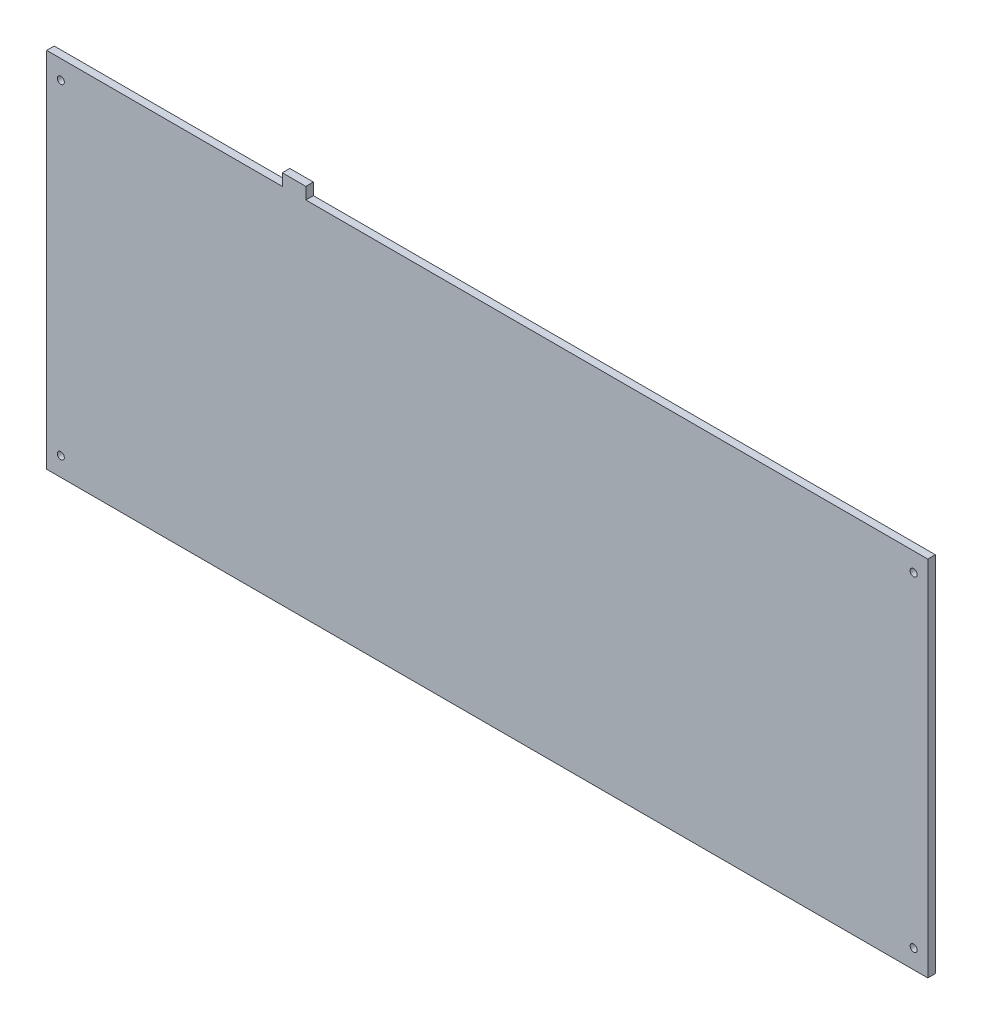
ISO-10303-21;
HEADER;
FILE_DESCRIPTION(('STEP AP214'),'2;1');
FILE_NAME('part.step','',(''),(''),'','','');
FILE_SCHEMA(('AUTOMOTIVE_DESIGN { 1 0 10303 214 1 1 1 1 }'));
ENDSEC;
DATA;
#1=APPLICATION_CONTEXT('core data for automotive mechanical design processes');
#2=APPLICATION_PROTOCOL_DEFINITION('international standard','automotive_design',2000,#1);
#3=PRODUCT_CONTEXT('',#1,'mechanical');
#4=PRODUCT('Part','Part','',(#3));
#5=PRODUCT_RELATED_PRODUCT_CATEGORY('part','',(#4));
#6=PRODUCT_DEFINITION_FORMATION('','',#4);
#7=PRODUCT_DEFINITION_CONTEXT('part definition',#1,'design');
#8=PRODUCT_DEFINITION('design','',#6,#7);
#9=PRODUCT_DEFINITION_SHAPE('','',#8);
#10=(LENGTH_UNIT() NAMED_UNIT(*) SI_UNIT(.MILLI.,.METRE.));
#11=(NAMED_UNIT(*) PLANE_ANGLE_UNIT() SI_UNIT($,.RADIAN.));
#12=(NAMED_UNIT(*) SI_UNIT($,.STERADIAN.) SOLID_ANGLE_UNIT());
#13=UNCERTAINTY_MEASURE_WITH_UNIT(LENGTH_MEASURE(1.E-05),#10,'distance_accuracy_value','');
#14=(GEOMETRIC_REPRESENTATION_CONTEXT(3) GLOBAL_UNCERTAINTY_ASSIGNED_CONTEXT((#13)) GLOBAL_UNIT_ASSIGNED_CONTEXT((#10,
#11,#12)) REPRESENTATION_CONTEXT('',''));
#15=CARTESIAN_POINT('',(0.,0.,0.));
#16=DIRECTION('',(0.,0.,1.));
#17=DIRECTION('',(1.,0.,0.));
#18=AXIS2_PLACEMENT_3D('',#15,#16,#17);
#19=CARTESIAN_POINT('',(0.06942582,-0.06797802,-1.6));
#20=DIRECTION('',(0.,1.,0.));
#21=DIRECTION('',(0.,0.,1.));
#22=AXIS2_PLACEMENT_3D('',#19,#20,#21);
#23=PLANE('',#22);
#24=DIRECTION('',(0.,0.,1.));
#25=VECTOR('',#24,1.);
#26=CARTESIAN_POINT('',(50.06942582,-0.06797802,-1.6));
#27=LINE('',#26,#25);
#28=CARTESIAN_POINT('',(50.06942582,-0.06797802,-1.6));
#29=VERTEX_POINT('',#28);
#30=CARTESIAN_POINT('',(50.06942582,-0.06797802,0.));
#31=VERTEX_POINT('',#30);
#32=EDGE_CURVE('E52',#29,#31,#27,.T.);
#33=ORIENTED_EDGE('',*,*,#32,.F.);
#34=DIRECTION('',(-1.,0.,0.));
#35=VECTOR('',#34,1.);
#36=CARTESIAN_POINT('',(0.06942582,-0.06797802,-1.6));
#37=LINE('',#36,#35);
#38=CARTESIAN_POINT('',(0.06942582,-0.06797802,-1.6));
#39=VERTEX_POINT('',#38);
#40=EDGE_CURVE('E160',#29,#39,#37,.T.);
#41=ORIENTED_EDGE('',*,*,#40,.T.);
#42=DIRECTION('',(0.,0.,1.));
#43=VECTOR('',#42,1.);
#44=CARTESIAN_POINT('',(0.06942582,-0.06797802,-1.6));
#45=LINE('',#44,#43);
#46=CARTESIAN_POINT('',(0.06942582,-0.06797802,0.));
#47=VERTEX_POINT('',#46);
#48=EDGE_CURVE('E44',#39,#47,#45,.T.);
#49=ORIENTED_EDGE('',*,*,#48,.T.);
#50=DIRECTION('',(-1.,0.,0.));
#51=VECTOR('',#50,1.);
#52=CARTESIAN_POINT('',(0.06942582,-0.06797802,0.));
#53=LINE('',#52,#51);
#54=EDGE_CURVE('E57',#31,#47,#53,.T.);
#55=ORIENTED_EDGE('',*,*,#54,.F.);
#56=EDGE_LOOP('',(#33,#41,#49,#55));
#57=FACE_BOUND('',#56,.T.);
#58=ADVANCED_FACE('F35',(#57),#23,.T.);
#59=CARTESIAN_POINT('',(0.06942582,-77.06797642,-1.6));
#60=DIRECTION('',(0.,-1.,0.));
#61=DIRECTION('',(0.,0.,-1.));
#62=AXIS2_PLACEMENT_3D('',#59,#60,#61);
#63=PLANE('',#62);
#64=DIRECTION('',(1.,0.,0.));
#65=VECTOR('',#64,1.);
#66=CARTESIAN_POINT('',(0.06942582,-77.06797642,0.));
#67=LINE('',#66,#65);
#68=CARTESIAN_POINT('',(0.06942582,-77.06797642,0.));
#69=VERTEX_POINT('',#68);
#70=CARTESIAN_POINT('',(187.06940742,-77.06797642,0.));
#71=VERTEX_POINT('',#70);
#72=EDGE_CURVE('E150',#69,#71,#67,.T.);
#73=ORIENTED_EDGE('',*,*,#72,.F.);
#74=DIRECTION('',(0.,0.,1.));
#75=VECTOR('',#74,1.);
#76=CARTESIAN_POINT('',(0.06942582,-77.06797642,-1.6));
#77=LINE('',#76,#75);
#78=CARTESIAN_POINT('',(0.06942582,-77.06797642,-1.6));
#79=VERTEX_POINT('',#78);
#80=EDGE_CURVE('E11',#79,#69,#77,.T.);
#81=ORIENTED_EDGE('',*,*,#80,.F.);
#82=DIRECTION('',(1.,0.,0.));
#83=VECTOR('',#82,1.);
#84=CARTESIAN_POINT('',(0.06942582,-77.06797642,-1.6));
#85=LINE('',#84,#83);
#86=CARTESIAN_POINT('',(187.06940742,-77.06797642,-1.6));
#87=VERTEX_POINT('',#86);
#88=EDGE_CURVE('E153',#79,#87,#85,.T.);
#89=ORIENTED_EDGE('',*,*,#88,.T.);
#90=DIRECTION('',(0.,0.,1.));
#91=VECTOR('',#90,1.);
#92=CARTESIAN_POINT('',(187.06940742,-77.06797642,-1.6));
#93=LINE('',#92,#91);
#94=EDGE_CURVE('E39',#87,#71,#93,.T.);
#95=ORIENTED_EDGE('',*,*,#94,.T.);
#96=EDGE_LOOP('',(#73,#81,#89,#95));
#97=FACE_BOUND('',#96,.T.);
#98=ADVANCED_FACE('F37',(#97),#63,.T.);
#99=CARTESIAN_POINT('',(0.06942582,-77.06797642,-1.6));
#100=DIRECTION('',(-1.,0.,0.));
#101=DIRECTION('',(0.,0.,1.));
#102=AXIS2_PLACEMENT_3D('',#99,#100,#101);
#103=PLANE('',#102);
#104=DIRECTION('',(0.,-1.,0.));
#105=VECTOR('',#104,1.);
#106=CARTESIAN_POINT('',(0.06942582,-77.06797642,0.));
#107=LINE('',#106,#105);
#108=EDGE_CURVE('E157',#47,#69,#107,.T.);
#109=ORIENTED_EDGE('',*,*,#108,.F.);
#110=ORIENTED_EDGE('',*,*,#48,.F.);
#111=DIRECTION('',(0.,-1.,0.));
#112=VECTOR('',#111,1.);
#113=CARTESIAN_POINT('',(0.06942582,-77.06797642,-1.6));
#114=LINE('',#113,#112);
#115=EDGE_CURVE('E163',#39,#79,#114,.T.);
#116=ORIENTED_EDGE('',*,*,#115,.T.);
#117=ORIENTED_EDGE('',*,*,#80,.T.);
#118=EDGE_LOOP('',(#109,#110,#116,#117));
#119=FACE_BOUND('',#118,.T.);
#120=ADVANCED_FACE('F186',(#119),#103,.T.);
#121=DIRECTION('',(0.,0.,-1.));
#122=VECTOR('',#121,1.);
#123=CARTESIAN_POINT('',(55.06942582,-0.06797802,-1.6));
#124=LINE('',#123,#122);
#125=CARTESIAN_POINT('',(55.06942582,-0.06797802,0.));
#126=VERTEX_POINT('',#125);
#127=CARTESIAN_POINT('',(55.06942582,-0.06797802,-1.6));
#128=VERTEX_POINT('',#127);
#129=EDGE_CURVE('E120',#126,#128,#124,.T.);
#130=ORIENTED_EDGE('',*,*,#129,.F.);
#131=CARTESIAN_POINT('',(187.06940742,-0.06797802,0.));
#132=VERTEX_POINT('',#131);
#133=EDGE_CURVE('E170',#132,#126,#53,.T.);
#134=ORIENTED_EDGE('',*,*,#133,.F.);
#135=DIRECTION('',(0.,0.,1.));
#136=VECTOR('',#135,1.);
#137=CARTESIAN_POINT('',(187.06940742,-0.06797802,-1.6));
#138=LINE('',#137,#136);
#139=CARTESIAN_POINT('',(187.06940742,-0.06797802,-1.6));
#140=VERTEX_POINT('',#139);
#141=EDGE_CURVE('E174',#140,#132,#138,.T.);
#142=ORIENTED_EDGE('',*,*,#141,.F.);
#143=EDGE_CURVE('E161',#140,#128,#37,.T.);
#144=ORIENTED_EDGE('',*,*,#143,.T.);
#145=EDGE_LOOP('',(#130,#134,#142,#144));
#146=FACE_BOUND('',#145,.T.);
#147=ADVANCED_FACE('F195',(#146),#23,.T.);
#148=CARTESIAN_POINT('',(187.06940742,-77.06797642,-1.6));
#149=DIRECTION('',(1.,0.,0.));
#150=DIRECTION('',(0.,0.,-1.));
#151=AXIS2_PLACEMENT_3D('',#148,#149,#150);
#152=PLANE('',#151);
#153=DIRECTION('',(0.,1.,0.));
#154=VECTOR('',#153,1.);
#155=CARTESIAN_POINT('',(187.06940742,-77.06797642,0.));
#156=LINE('',#155,#154);
#157=EDGE_CURVE('E167',#71,#132,#156,.T.);
#158=ORIENTED_EDGE('',*,*,#157,.F.);
#159=ORIENTED_EDGE('',*,*,#94,.F.);
#160=DIRECTION('',(0.,1.,0.));
#161=VECTOR('',#160,1.);
#162=CARTESIAN_POINT('',(187.06940742,-77.06797642,-1.6));
#163=LINE('',#162,#161);
#164=EDGE_CURVE('E156',#87,#140,#163,.T.);
#165=ORIENTED_EDGE('',*,*,#164,.T.);
#166=ORIENTED_EDGE('',*,*,#141,.T.);
#167=EDGE_LOOP('',(#158,#159,#165,#166));
#168=FACE_BOUND('',#167,.T.);
#169=ADVANCED_FACE('F182',(#168),#152,.T.);
#170=CARTESIAN_POINT('',(0.,0.,-1.6));
#171=DIRECTION('',(0.,0.,1.));
#172=DIRECTION('',(1.,0.,0.));
#173=AXIS2_PLACEMENT_3D('',#170,#171,#172);
#174=PLANE('',#173);
#175=CARTESIAN_POINT('',(3.0693995,-4.0680005,-1.6));
#176=DIRECTION('',(0.,0.,1.));
#177=DIRECTION('',(1.,0.,0.));
#178=AXIS2_PLACEMENT_3D('',#175,#176,#177);
#179=CIRCLE('',#178,0.7499985);
#180=CARTESIAN_POINT('',(3.819398,-4.0680005,-1.6));
#181=VERTEX_POINT('',#180);
#182=EDGE_CURVE('E135',#181,#181,#179,.T.);
#183=ORIENTED_EDGE('',*,*,#182,.T.);
#184=EDGE_LOOP('',(#183));
#185=FACE_BOUND('',#184,.T.);
#186=CARTESIAN_POINT('',(184.06940072,-73.06799966,-1.6));
#187=DIRECTION('',(0.,0.,1.));
#188=DIRECTION('',(1.,0.,0.));
#189=AXIS2_PLACEMENT_3D('',#186,#187,#188);
#190=CIRCLE('',#189,0.749998500000015);
#191=CARTESIAN_POINT('',(184.81939922,-73.06799966,-1.6));
#192=VERTEX_POINT('',#191);
#193=EDGE_CURVE('E142',#192,#192,#190,.T.);
#194=ORIENTED_EDGE('',*,*,#193,.T.);
#195=EDGE_LOOP('',(#194));
#196=FACE_BOUND('',#195,.T.);
#197=CARTESIAN_POINT('',(184.06940072,-4.0680005,-1.6));
#198=DIRECTION('',(0.,0.,1.));
#199=DIRECTION('',(1.,0.,0.));
#200=AXIS2_PLACEMENT_3D('',#197,#198,#199);
#201=CIRCLE('',#200,0.749998500000015);
#202=CARTESIAN_POINT('',(184.81939922,-4.0680005,-1.6));
#203=VERTEX_POINT('',#202);
#204=EDGE_CURVE('E126',#203,#203,#201,.T.);
#205=ORIENTED_EDGE('',*,*,#204,.T.);
#206=EDGE_LOOP('',(#205));
#207=FACE_BOUND('',#206,.T.);
#208=CARTESIAN_POINT('',(3.0693995,-73.06799966,-1.6));
#209=DIRECTION('',(0.,0.,1.));
#210=DIRECTION('',(1.,0.,0.));
#211=AXIS2_PLACEMENT_3D('',#208,#209,#210);
#212=CIRCLE('',#211,0.7499985);
#213=CARTESIAN_POINT('',(3.819398,-73.06799966,-1.6));
#214=VERTEX_POINT('',#213);
#215=EDGE_CURVE('E147',#214,#214,#212,.T.);
#216=ORIENTED_EDGE('',*,*,#215,.T.);
#217=EDGE_LOOP('',(#216));
#218=FACE_BOUND('',#217,.T.);
#219=ORIENTED_EDGE('',*,*,#88,.F.);
#220=ORIENTED_EDGE('',*,*,#115,.F.);
#221=ORIENTED_EDGE('',*,*,#40,.F.);
#222=DIRECTION('',(0.,-1.,0.));
#223=VECTOR('',#222,1.);
#224=CARTESIAN_POINT('',(50.06942582,2.43202198,-1.6));
#225=LINE('',#224,#223);
#226=CARTESIAN_POINT('',(50.06942582,2.43202198,-1.6));
#227=VERTEX_POINT('',#226);
#228=EDGE_CURVE('E202',#227,#29,#225,.T.);
#229=ORIENTED_EDGE('',*,*,#228,.F.);
#230=DIRECTION('',(-1.,0.,0.));
#231=VECTOR('',#230,1.);
#232=CARTESIAN_POINT('',(50.06942582,2.43202198,-1.6));
#233=LINE('',#232,#231);
#234=CARTESIAN_POINT('',(55.06942582,2.43202198,-1.6));
#235=VERTEX_POINT('',#234);
#236=EDGE_CURVE('E116',#235,#227,#233,.T.);
#237=ORIENTED_EDGE('',*,*,#236,.F.);
#238=DIRECTION('',(0.,-1.,0.));
#239=VECTOR('',#238,1.);
#240=CARTESIAN_POINT('',(55.06942582,2.43202198,-1.6));
#241=LINE('',#240,#239);
#242=EDGE_CURVE('E128',#235,#128,#241,.T.);
#243=ORIENTED_EDGE('',*,*,#242,.T.);
#244=ORIENTED_EDGE('',*,*,#143,.F.);
#245=ORIENTED_EDGE('',*,*,#164,.F.);
#246=EDGE_LOOP('',(#219,#220,#221,#229,#237,#243,#244,#245));
#247=FACE_BOUND('',#246,.T.);
#248=ADVANCED_FACE('F189',(#185,#196,#207,#218,#247),#174,.F.);
#249=CARTESIAN_POINT('',(0.,0.,0.));
#250=DIRECTION('',(0.,0.,1.));
#251=DIRECTION('',(1.,0.,0.));
#252=AXIS2_PLACEMENT_3D('',#249,#250,#251);
#253=PLANE('',#252);
#254=CARTESIAN_POINT('',(3.0693995,-4.0680005,0.));
#255=DIRECTION('',(0.,0.,1.));
#256=DIRECTION('',(1.,0.,0.));
#257=AXIS2_PLACEMENT_3D('',#254,#255,#256);
#258=CIRCLE('',#257,0.7499985);
#259=CARTESIAN_POINT('',(3.819398,-4.0680005,0.));
#260=VERTEX_POINT('',#259);
#261=EDGE_CURVE('E139',#260,#260,#258,.T.);
#262=ORIENTED_EDGE('',*,*,#261,.F.);
#263=EDGE_LOOP('',(#262));
#264=FACE_BOUND('',#263,.T.);
#265=CARTESIAN_POINT('',(184.06940072,-73.06799966,0.));
#266=DIRECTION('',(0.,0.,1.));
#267=DIRECTION('',(1.,0.,0.));
#268=AXIS2_PLACEMENT_3D('',#265,#266,#267);
#269=CIRCLE('',#268,0.749998500000015);
#270=CARTESIAN_POINT('',(184.81939922,-73.06799966,0.));
#271=VERTEX_POINT('',#270);
#272=EDGE_CURVE('E133',#271,#271,#269,.T.);
#273=ORIENTED_EDGE('',*,*,#272,.F.);
#274=EDGE_LOOP('',(#273));
#275=FACE_BOUND('',#274,.T.);
#276=CARTESIAN_POINT('',(184.06940072,-4.0680005,0.));
#277=DIRECTION('',(0.,0.,1.));
#278=DIRECTION('',(1.,0.,0.));
#279=AXIS2_PLACEMENT_3D('',#276,#277,#278);
#280=CIRCLE('',#279,0.749998500000015);
#281=CARTESIAN_POINT('',(184.81939922,-4.0680005,0.));
#282=VERTEX_POINT('',#281);
#283=EDGE_CURVE('E123',#282,#282,#280,.T.);
#284=ORIENTED_EDGE('',*,*,#283,.F.);
#285=EDGE_LOOP('',(#284));
#286=FACE_BOUND('',#285,.T.);
#287=CARTESIAN_POINT('',(3.0693995,-73.06799966,0.));
#288=DIRECTION('',(0.,0.,1.));
#289=DIRECTION('',(1.,0.,0.));
#290=AXIS2_PLACEMENT_3D('',#287,#288,#289);
#291=CIRCLE('',#290,0.7499985);
#292=CARTESIAN_POINT('',(3.819398,-73.06799966,0.));
#293=VERTEX_POINT('',#292);
#294=EDGE_CURVE('E138',#293,#293,#291,.T.);
#295=ORIENTED_EDGE('',*,*,#294,.F.);
#296=EDGE_LOOP('',(#295));
#297=FACE_BOUND('',#296,.T.);
#298=ORIENTED_EDGE('',*,*,#72,.T.);
#299=ORIENTED_EDGE('',*,*,#157,.T.);
#300=ORIENTED_EDGE('',*,*,#133,.T.);
#301=DIRECTION('',(0.,-1.,0.));
#302=VECTOR('',#301,1.);
#303=CARTESIAN_POINT('',(55.06942582,2.43202198,0.));
#304=LINE('',#303,#302);
#305=CARTESIAN_POINT('',(55.06942582,2.43202198,0.));
#306=VERTEX_POINT('',#305);
#307=EDGE_CURVE('E107',#306,#126,#304,.T.);
#308=ORIENTED_EDGE('',*,*,#307,.F.);
#309=DIRECTION('',(1.,0.,0.));
#310=VECTOR('',#309,1.);
#311=CARTESIAN_POINT('',(50.06942582,2.43202198,0.));
#312=LINE('',#311,#310);
#313=CARTESIAN_POINT('',(50.06942582,2.43202198,0.));
#314=VERTEX_POINT('',#313);
#315=EDGE_CURVE('E99',#314,#306,#312,.T.);
#316=ORIENTED_EDGE('',*,*,#315,.F.);
#317=DIRECTION('',(0.,-1.,0.));
#318=VECTOR('',#317,1.);
#319=CARTESIAN_POINT('',(50.06942582,2.43202198,0.));
#320=LINE('',#319,#318);
#321=EDGE_CURVE('E104',#314,#31,#320,.T.);
#322=ORIENTED_EDGE('',*,*,#321,.T.);
#323=ORIENTED_EDGE('',*,*,#54,.T.);
#324=ORIENTED_EDGE('',*,*,#108,.T.);
#325=EDGE_LOOP('',(#298,#299,#300,#308,#316,#322,#323,#324));
#326=FACE_BOUND('',#325,.T.);
#327=ADVANCED_FACE('F102',(#264,#275,#286,#297,#326),#253,.T.);
#328=CARTESIAN_POINT('',(3.0693995,-73.06799966,-1.6));
#329=DIRECTION('',(0.,0.,1.));
#330=DIRECTION('',(1.,0.,0.));
#331=AXIS2_PLACEMENT_3D('',#328,#329,#330);
#332=CYLINDRICAL_SURFACE('',#331,0.7499985);
#333=ORIENTED_EDGE('',*,*,#215,.F.);
#334=EDGE_LOOP('',(#333));
#335=FACE_BOUND('',#334,.T.);
#336=ORIENTED_EDGE('',*,*,#294,.T.);
#337=EDGE_LOOP('',(#336));
#338=FACE_BOUND('',#337,.T.);
#339=ADVANCED_FACE('F220',(#335,#338),#332,.F.);
#340=CARTESIAN_POINT('',(184.06940072,-4.0680005,-1.6));
#341=DIRECTION('',(0.,0.,1.));
#342=DIRECTION('',(1.,0.,0.));
#343=AXIS2_PLACEMENT_3D('',#340,#341,#342);
#344=CYLINDRICAL_SURFACE('',#343,0.749998500000015);
#345=ORIENTED_EDGE('',*,*,#204,.F.);
#346=EDGE_LOOP('',(#345));
#347=FACE_BOUND('',#346,.T.);
#348=ORIENTED_EDGE('',*,*,#283,.T.);
#349=EDGE_LOOP('',(#348));
#350=FACE_BOUND('',#349,.T.);
#351=ADVANCED_FACE('F227',(#347,#350),#344,.F.);
#352=CARTESIAN_POINT('',(184.06940072,-73.06799966,-1.6));
#353=DIRECTION('',(0.,0.,1.));
#354=DIRECTION('',(1.,0.,0.));
#355=AXIS2_PLACEMENT_3D('',#352,#353,#354);
#356=CYLINDRICAL_SURFACE('',#355,0.749998500000015);
#357=ORIENTED_EDGE('',*,*,#193,.F.);
#358=EDGE_LOOP('',(#357));
#359=FACE_BOUND('',#358,.T.);
#360=ORIENTED_EDGE('',*,*,#272,.T.);
#361=EDGE_LOOP('',(#360));
#362=FACE_BOUND('',#361,.T.);
#363=ADVANCED_FACE('F229',(#359,#362),#356,.F.);
#364=CARTESIAN_POINT('',(3.0693995,-4.0680005,-1.6));
#365=DIRECTION('',(0.,0.,1.));
#366=DIRECTION('',(1.,0.,0.));
#367=AXIS2_PLACEMENT_3D('',#364,#365,#366);
#368=CYLINDRICAL_SURFACE('',#367,0.7499985);
#369=ORIENTED_EDGE('',*,*,#182,.F.);
#370=EDGE_LOOP('',(#369));
#371=FACE_BOUND('',#370,.T.);
#372=ORIENTED_EDGE('',*,*,#261,.T.);
#373=EDGE_LOOP('',(#372));
#374=FACE_BOUND('',#373,.T.);
#375=ADVANCED_FACE('F232',(#371,#374),#368,.F.);
#376=CARTESIAN_POINT('',(50.06942582,2.43202198,-1.6));
#377=DIRECTION('',(1.,0.,0.));
#378=DIRECTION('',(0.,0.,-1.));
#379=AXIS2_PLACEMENT_3D('',#376,#377,#378);
#380=PLANE('',#379);
#381=ORIENTED_EDGE('',*,*,#32,.T.);
#382=ORIENTED_EDGE('',*,*,#321,.F.);
#383=DIRECTION('',(0.,0.,1.));
#384=VECTOR('',#383,1.);
#385=CARTESIAN_POINT('',(50.06942582,2.43202198,-1.6));
#386=LINE('',#385,#384);
#387=EDGE_CURVE('E111',#227,#314,#386,.T.);
#388=ORIENTED_EDGE('',*,*,#387,.F.);
#389=ORIENTED_EDGE('',*,*,#228,.T.);
#390=EDGE_LOOP('',(#381,#382,#388,#389));
#391=FACE_BOUND('',#390,.T.);
#392=ADVANCED_FACE('F122',(#391),#380,.F.);
#393=CARTESIAN_POINT('',(55.06942582,2.43202198,-1.6));
#394=DIRECTION('',(-1.,0.,0.));
#395=DIRECTION('',(0.,0.,1.));
#396=AXIS2_PLACEMENT_3D('',#393,#394,#395);
#397=PLANE('',#396);
#398=ORIENTED_EDGE('',*,*,#129,.T.);
#399=ORIENTED_EDGE('',*,*,#242,.F.);
#400=DIRECTION('',(0.,0.,-1.));
#401=VECTOR('',#400,1.);
#402=CARTESIAN_POINT('',(55.06942582,2.43202198,-1.6));
#403=LINE('',#402,#401);
#404=EDGE_CURVE('E110',#306,#235,#403,.T.);
#405=ORIENTED_EDGE('',*,*,#404,.F.);
#406=ORIENTED_EDGE('',*,*,#307,.T.);
#407=EDGE_LOOP('',(#398,#399,#405,#406));
#408=FACE_BOUND('',#407,.T.);
#409=ADVANCED_FACE('F197',(#408),#397,.F.);
#410=CARTESIAN_POINT('',(0.,2.43202198,0.));
#411=DIRECTION('',(0.,1.,0.));
#412=DIRECTION('',(0.,0.,1.));
#413=AXIS2_PLACEMENT_3D('',#410,#411,#412);
#414=PLANE('',#413);
#415=ORIENTED_EDGE('',*,*,#387,.T.);
#416=ORIENTED_EDGE('',*,*,#315,.T.);
#417=ORIENTED_EDGE('',*,*,#404,.T.);
#418=ORIENTED_EDGE('',*,*,#236,.T.);
#419=EDGE_LOOP('',(#415,#416,#417,#418));
#420=FACE_BOUND('',#419,.T.);
#421=ADVANCED_FACE('F114',(#420),#414,.T.);
#422=CLOSED_SHELL('',(#58,#98,#120,#147,#169,#248,#327,#339,#351,#363,#375,#392,#409,#421));
#423=MANIFOLD_SOLID_BREP('B2',#422);
#424=ADVANCED_BREP_SHAPE_REPRESENTATION('',(#18,#423),#14);
#425=SHAPE_DEFINITION_REPRESENTATION(#9,#424);
ENDSEC;
END-ISO-10303-21;
